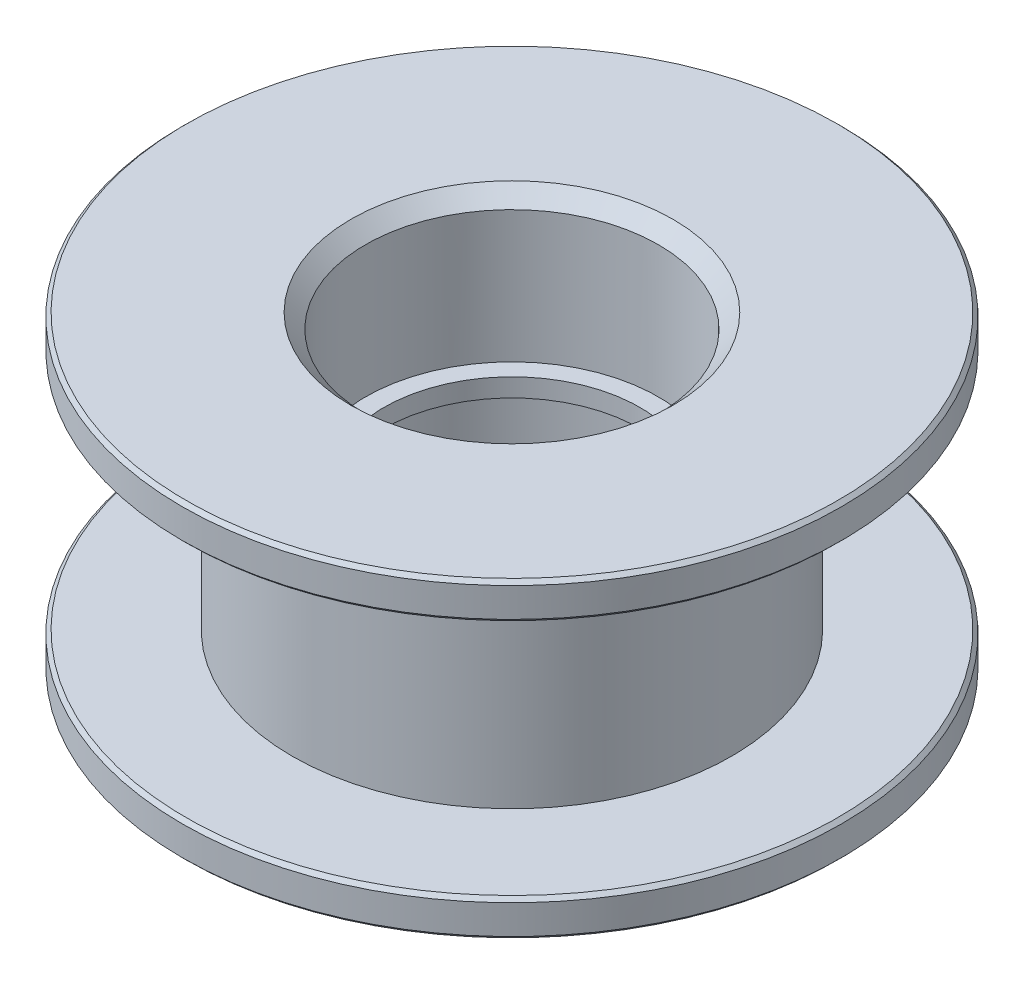
ISO-10303-21;
HEADER;
FILE_DESCRIPTION(('STEP AP214'),'2;1');
FILE_NAME('part.step','',(''),(''),'','','');
FILE_SCHEMA(('AUTOMOTIVE_DESIGN { 1 0 10303 214 1 1 1 1 }'));
ENDSEC;
DATA;
#1=APPLICATION_CONTEXT('core data for automotive mechanical design processes');
#2=APPLICATION_PROTOCOL_DEFINITION('international standard','automotive_design',2000,#1);
#3=PRODUCT_CONTEXT('',#1,'mechanical');
#4=PRODUCT('Part','Part','',(#3));
#5=PRODUCT_RELATED_PRODUCT_CATEGORY('part','',(#4));
#6=PRODUCT_DEFINITION_FORMATION('','',#4);
#7=PRODUCT_DEFINITION_CONTEXT('part definition',#1,'design');
#8=PRODUCT_DEFINITION('design','',#6,#7);
#9=PRODUCT_DEFINITION_SHAPE('','',#8);
#10=(LENGTH_UNIT() NAMED_UNIT(*) SI_UNIT(.MILLI.,.METRE.));
#11=(NAMED_UNIT(*) PLANE_ANGLE_UNIT() SI_UNIT($,.RADIAN.));
#12=(NAMED_UNIT(*) SI_UNIT($,.STERADIAN.) SOLID_ANGLE_UNIT());
#13=UNCERTAINTY_MEASURE_WITH_UNIT(LENGTH_MEASURE(1.E-05),#10,'distance_accuracy_value','');
#14=(GEOMETRIC_REPRESENTATION_CONTEXT(3) GLOBAL_UNCERTAINTY_ASSIGNED_CONTEXT((#13)) GLOBAL_UNIT_ASSIGNED_CONTEXT((#10,
#11,#12)) REPRESENTATION_CONTEXT('',''));
#15=CARTESIAN_POINT('',(0.,0.,0.));
#16=DIRECTION('',(0.,0.,1.));
#17=DIRECTION('',(1.,0.,0.));
#18=AXIS2_PLACEMENT_3D('',#15,#16,#17);
#19=CARTESIAN_POINT('',(6.,3.25,0.));
#20=DIRECTION('',(0.,1.,0.));
#21=DIRECTION('',(0.,0.,1.));
#22=AXIS2_PLACEMENT_3D('',#19,#20,#21);
#23=PLANE('',#22);
#24=CARTESIAN_POINT('',(0.,3.25,0.));
#25=DIRECTION('',(0.,1.,0.));
#26=DIRECTION('',(0.,0.,1.));
#27=AXIS2_PLACEMENT_3D('',#24,#25,#26);
#28=CIRCLE('',#27,8.9);
#29=CARTESIAN_POINT('',(0.,3.25,8.9));
#30=VERTEX_POINT('',#29);
#31=EDGE_CURVE('E42',#30,#30,#28,.F.);
#32=ORIENTED_EDGE('',*,*,#31,.T.);
#33=EDGE_LOOP('',(#32));
#34=FACE_BOUND('',#33,.T.);
#35=CARTESIAN_POINT('',(0.,3.25,0.));
#36=DIRECTION('',(0.,1.,0.));
#37=DIRECTION('',(0.,0.,1.));
#38=AXIS2_PLACEMENT_3D('',#35,#36,#37);
#39=CIRCLE('',#38,6.);
#40=CARTESIAN_POINT('',(0.,3.25,6.));
#41=VERTEX_POINT('',#40);
#42=EDGE_CURVE('E110',#41,#41,#39,.T.);
#43=ORIENTED_EDGE('',*,*,#42,.T.);
#44=EDGE_LOOP('',(#43));
#45=FACE_BOUND('',#44,.T.);
#46=ADVANCED_FACE('F34',(#34,#45),#23,.F.);
#47=CARTESIAN_POINT('',(0.,4.25,0.));
#48=DIRECTION('',(0.,1.,0.));
#49=DIRECTION('',(0.,0.,1.));
#50=AXIS2_PLACEMENT_3D('',#47,#48,#49);
#51=CYLINDRICAL_SURFACE('',#50,9.);
#52=CARTESIAN_POINT('',(0.,3.35,0.));
#53=DIRECTION('',(0.,1.,0.));
#54=DIRECTION('',(0.,0.,1.));
#55=AXIS2_PLACEMENT_3D('',#52,#53,#54);
#56=CIRCLE('',#55,9.);
#57=CARTESIAN_POINT('',(0.,3.35,9.));
#58=VERTEX_POINT('',#57);
#59=EDGE_CURVE('E49',#58,#58,#56,.T.);
#60=ORIENTED_EDGE('',*,*,#59,.T.);
#61=EDGE_LOOP('',(#60));
#62=FACE_BOUND('',#61,.T.);
#63=CARTESIAN_POINT('',(0.,4.15,0.));
#64=DIRECTION('',(0.,-1.,0.));
#65=DIRECTION('',(0.,0.,-1.));
#66=AXIS2_PLACEMENT_3D('',#63,#64,#65);
#67=CIRCLE('',#66,9.);
#68=CARTESIAN_POINT('',(0.,4.15,-9.));
#69=VERTEX_POINT('',#68);
#70=EDGE_CURVE('E56',#69,#69,#67,.T.);
#71=ORIENTED_EDGE('',*,*,#70,.T.);
#72=EDGE_LOOP('',(#71));
#73=FACE_BOUND('',#72,.T.);
#74=ADVANCED_FACE('F135',(#62,#73),#51,.T.);
#75=CARTESIAN_POINT('',(9.,4.25,0.));
#76=DIRECTION('',(0.,-1.,0.));
#77=DIRECTION('',(0.,0.,-1.));
#78=AXIS2_PLACEMENT_3D('',#75,#76,#77);
#79=PLANE('',#78);
#80=CARTESIAN_POINT('',(0.,4.25,0.));
#81=DIRECTION('',(0.,-1.,0.));
#82=DIRECTION('',(0.,0.,-1.));
#83=AXIS2_PLACEMENT_3D('',#80,#81,#82);
#84=CIRCLE('',#83,8.9);
#85=CARTESIAN_POINT('',(0.,4.25,-8.9));
#86=VERTEX_POINT('',#85);
#87=EDGE_CURVE('E10',#86,#86,#84,.F.);
#88=ORIENTED_EDGE('',*,*,#87,.T.);
#89=EDGE_LOOP('',(#88));
#90=FACE_BOUND('',#89,.T.);
#91=CARTESIAN_POINT('',(0.,4.25,0.));
#92=DIRECTION('',(0.,-1.,0.));
#93=DIRECTION('',(0.,0.,-1.));
#94=AXIS2_PLACEMENT_3D('',#91,#92,#93);
#95=CIRCLE('',#94,4.4);
#96=CARTESIAN_POINT('',(0.,4.25,-4.4));
#97=VERTEX_POINT('',#96);
#98=EDGE_CURVE('E76',#97,#97,#95,.T.);
#99=ORIENTED_EDGE('',*,*,#98,.T.);
#100=EDGE_LOOP('',(#99));
#101=FACE_BOUND('',#100,.T.);
#102=ADVANCED_FACE('F140',(#90,#101),#79,.F.);
#103=CARTESIAN_POINT('',(0.,4.25,0.));
#104=DIRECTION('',(0.,1.,0.));
#105=DIRECTION('',(0.,0.,1.));
#106=AXIS2_PLACEMENT_3D('',#103,#104,#105);
#107=CYLINDRICAL_SURFACE('',#106,4.);
#108=CARTESIAN_POINT('',(0.,3.85,0.));
#109=DIRECTION('',(0.,-1.,0.));
#110=DIRECTION('',(0.,0.,-1.));
#111=AXIS2_PLACEMENT_3D('',#108,#109,#110);
#112=CIRCLE('',#111,4.);
#113=CARTESIAN_POINT('',(0.,3.85,-4.));
#114=VERTEX_POINT('',#113);
#115=EDGE_CURVE('E80',#114,#114,#112,.F.);
#116=ORIENTED_EDGE('',*,*,#115,.T.);
#117=EDGE_LOOP('',(#116));
#118=FACE_BOUND('',#117,.T.);
#119=CARTESIAN_POINT('',(0.,0.25,0.));
#120=DIRECTION('',(0.,1.,0.));
#121=DIRECTION('',(0.,0.,1.));
#122=AXIS2_PLACEMENT_3D('',#119,#120,#121);
#123=CIRCLE('',#122,4.);
#124=CARTESIAN_POINT('',(0.,0.25,4.));
#125=VERTEX_POINT('',#124);
#126=EDGE_CURVE('E90',#125,#125,#123,.T.);
#127=ORIENTED_EDGE('',*,*,#126,.F.);
#128=EDGE_LOOP('',(#127));
#129=FACE_BOUND('',#128,.T.);
#130=ADVANCED_FACE('F255',(#118,#129),#107,.F.);
#131=CARTESIAN_POINT('',(4.,0.25,0.));
#132=DIRECTION('',(0.,-1.,0.));
#133=DIRECTION('',(0.,0.,-1.));
#134=AXIS2_PLACEMENT_3D('',#131,#132,#133);
#135=PLANE('',#134);
#136=CARTESIAN_POINT('',(0.,0.25,0.));
#137=DIRECTION('',(0.,1.,0.));
#138=DIRECTION('',(0.,0.,1.));
#139=AXIS2_PLACEMENT_3D('',#136,#137,#138);
#140=CIRCLE('',#139,3.5);
#141=CARTESIAN_POINT('',(0.,0.25,3.5));
#142=VERTEX_POINT('',#141);
#143=EDGE_CURVE('E94',#142,#142,#140,.T.);
#144=ORIENTED_EDGE('',*,*,#143,.F.);
#145=EDGE_LOOP('',(#144));
#146=FACE_BOUND('',#145,.T.);
#147=ORIENTED_EDGE('',*,*,#126,.T.);
#148=EDGE_LOOP('',(#147));
#149=FACE_BOUND('',#148,.T.);
#150=ADVANCED_FACE('F246',(#146,#149),#135,.F.);
#151=CARTESIAN_POINT('',(0.,4.25,0.));
#152=DIRECTION('',(0.,1.,0.));
#153=DIRECTION('',(0.,0.,1.));
#154=AXIS2_PLACEMENT_3D('',#151,#152,#153);
#155=CYLINDRICAL_SURFACE('',#154,3.5);
#156=CARTESIAN_POINT('',(0.,-0.25,0.));
#157=DIRECTION('',(0.,1.,0.));
#158=DIRECTION('',(0.,0.,1.));
#159=AXIS2_PLACEMENT_3D('',#156,#157,#158);
#160=CIRCLE('',#159,3.5);
#161=CARTESIAN_POINT('',(0.,-0.25,3.5));
#162=VERTEX_POINT('',#161);
#163=EDGE_CURVE('E98',#162,#162,#160,.T.);
#164=ORIENTED_EDGE('',*,*,#163,.F.);
#165=EDGE_LOOP('',(#164));
#166=FACE_BOUND('',#165,.T.);
#167=ORIENTED_EDGE('',*,*,#143,.T.);
#168=EDGE_LOOP('',(#167));
#169=FACE_BOUND('',#168,.T.);
#170=ADVANCED_FACE('F237',(#166,#169),#155,.F.);
#171=CARTESIAN_POINT('',(3.5,-0.25,0.));
#172=DIRECTION('',(0.,1.,0.));
#173=DIRECTION('',(0.,0.,1.));
#174=AXIS2_PLACEMENT_3D('',#171,#172,#173);
#175=PLANE('',#174);
#176=CARTESIAN_POINT('',(0.,-0.25,0.));
#177=DIRECTION('',(0.,1.,0.));
#178=DIRECTION('',(0.,0.,1.));
#179=AXIS2_PLACEMENT_3D('',#176,#177,#178);
#180=CIRCLE('',#179,4.);
#181=CARTESIAN_POINT('',(0.,-0.25,4.));
#182=VERTEX_POINT('',#181);
#183=EDGE_CURVE('E102',#182,#182,#180,.T.);
#184=ORIENTED_EDGE('',*,*,#183,.F.);
#185=EDGE_LOOP('',(#184));
#186=FACE_BOUND('',#185,.T.);
#187=ORIENTED_EDGE('',*,*,#163,.T.);
#188=EDGE_LOOP('',(#187));
#189=FACE_BOUND('',#188,.T.);
#190=ADVANCED_FACE('F229',(#186,#189),#175,.F.);
#191=CARTESIAN_POINT('',(0.,4.25,0.));
#192=DIRECTION('',(0.,1.,0.));
#193=DIRECTION('',(0.,0.,1.));
#194=AXIS2_PLACEMENT_3D('',#191,#192,#193);
#195=CYLINDRICAL_SURFACE('',#194,4.);
#196=CARTESIAN_POINT('',(0.,-3.85,0.));
#197=DIRECTION('',(0.,1.,0.));
#198=DIRECTION('',(0.,0.,1.));
#199=AXIS2_PLACEMENT_3D('',#196,#197,#198);
#200=CIRCLE('',#199,4.);
#201=CARTESIAN_POINT('',(0.,-3.85,4.));
#202=VERTEX_POINT('',#201);
#203=EDGE_CURVE('E83',#202,#202,#200,.F.);
#204=ORIENTED_EDGE('',*,*,#203,.T.);
#205=EDGE_LOOP('',(#204));
#206=FACE_BOUND('',#205,.T.);
#207=ORIENTED_EDGE('',*,*,#183,.T.);
#208=EDGE_LOOP('',(#207));
#209=FACE_BOUND('',#208,.T.);
#210=ADVANCED_FACE('F220',(#206,#209),#195,.F.);
#211=CARTESIAN_POINT('',(4.,-4.25,0.));
#212=DIRECTION('',(0.,1.,0.));
#213=DIRECTION('',(0.,0.,1.));
#214=AXIS2_PLACEMENT_3D('',#211,#212,#213);
#215=PLANE('',#214);
#216=CARTESIAN_POINT('',(0.,-4.25,0.));
#217=DIRECTION('',(0.,1.,0.));
#218=DIRECTION('',(0.,0.,1.));
#219=AXIS2_PLACEMENT_3D('',#216,#217,#218);
#220=CIRCLE('',#219,8.9);
#221=CARTESIAN_POINT('',(0.,-4.25,8.9));
#222=VERTEX_POINT('',#221);
#223=EDGE_CURVE('E65',#222,#222,#220,.F.);
#224=ORIENTED_EDGE('',*,*,#223,.T.);
#225=EDGE_LOOP('',(#224));
#226=FACE_BOUND('',#225,.T.);
#227=CARTESIAN_POINT('',(0.,-4.25,0.));
#228=DIRECTION('',(0.,1.,0.));
#229=DIRECTION('',(0.,0.,1.));
#230=AXIS2_PLACEMENT_3D('',#227,#228,#229);
#231=CIRCLE('',#230,4.4);
#232=CARTESIAN_POINT('',(0.,-4.25,4.4));
#233=VERTEX_POINT('',#232);
#234=EDGE_CURVE('E86',#233,#233,#231,.T.);
#235=ORIENTED_EDGE('',*,*,#234,.T.);
#236=EDGE_LOOP('',(#235));
#237=FACE_BOUND('',#236,.T.);
#238=ADVANCED_FACE('F131',(#226,#237),#215,.F.);
#239=CARTESIAN_POINT('',(0.,4.25,0.));
#240=DIRECTION('',(0.,1.,0.));
#241=DIRECTION('',(0.,0.,1.));
#242=AXIS2_PLACEMENT_3D('',#239,#240,#241);
#243=CYLINDRICAL_SURFACE('',#242,9.);
#244=CARTESIAN_POINT('',(0.,-4.15,0.));
#245=DIRECTION('',(0.,1.,0.));
#246=DIRECTION('',(0.,0.,1.));
#247=AXIS2_PLACEMENT_3D('',#244,#245,#246);
#248=CIRCLE('',#247,9.);
#249=CARTESIAN_POINT('',(0.,-4.15,9.));
#250=VERTEX_POINT('',#249);
#251=EDGE_CURVE('E69',#250,#250,#248,.T.);
#252=ORIENTED_EDGE('',*,*,#251,.T.);
#253=EDGE_LOOP('',(#252));
#254=FACE_BOUND('',#253,.T.);
#255=CARTESIAN_POINT('',(0.,-3.35,0.));
#256=DIRECTION('',(0.,-1.,0.));
#257=DIRECTION('',(0.,0.,-1.));
#258=AXIS2_PLACEMENT_3D('',#255,#256,#257);
#259=CIRCLE('',#258,9.);
#260=CARTESIAN_POINT('',(0.,-3.35,-9.));
#261=VERTEX_POINT('',#260);
#262=EDGE_CURVE('E73',#261,#261,#259,.T.);
#263=ORIENTED_EDGE('',*,*,#262,.T.);
#264=EDGE_LOOP('',(#263));
#265=FACE_BOUND('',#264,.T.);
#266=ADVANCED_FACE('F125',(#254,#265),#243,.T.);
#267=CARTESIAN_POINT('',(9.,-3.25,0.));
#268=DIRECTION('',(0.,-1.,0.));
#269=DIRECTION('',(0.,0.,-1.));
#270=AXIS2_PLACEMENT_3D('',#267,#268,#269);
#271=PLANE('',#270);
#272=CARTESIAN_POINT('',(0.,-3.25,0.));
#273=DIRECTION('',(0.,-1.,0.));
#274=DIRECTION('',(0.,0.,-1.));
#275=AXIS2_PLACEMENT_3D('',#272,#273,#274);
#276=CIRCLE('',#275,8.9);
#277=CARTESIAN_POINT('',(0.,-3.25,-8.9));
#278=VERTEX_POINT('',#277);
#279=EDGE_CURVE('E62',#278,#278,#276,.F.);
#280=ORIENTED_EDGE('',*,*,#279,.T.);
#281=EDGE_LOOP('',(#280));
#282=FACE_BOUND('',#281,.T.);
#283=CARTESIAN_POINT('',(0.,-3.25,0.));
#284=DIRECTION('',(0.,1.,0.));
#285=DIRECTION('',(0.,0.,1.));
#286=AXIS2_PLACEMENT_3D('',#283,#284,#285);
#287=CIRCLE('',#286,6.);
#288=CARTESIAN_POINT('',(0.,-3.25,6.));
#289=VERTEX_POINT('',#288);
#290=EDGE_CURVE('E106',#289,#289,#287,.T.);
#291=ORIENTED_EDGE('',*,*,#290,.F.);
#292=EDGE_LOOP('',(#291));
#293=FACE_BOUND('',#292,.T.);
#294=ADVANCED_FACE('F120',(#282,#293),#271,.F.);
#295=CARTESIAN_POINT('',(0.,4.25,0.));
#296=DIRECTION('',(0.,1.,0.));
#297=DIRECTION('',(0.,0.,1.));
#298=AXIS2_PLACEMENT_3D('',#295,#296,#297);
#299=CYLINDRICAL_SURFACE('',#298,6.);
#300=ORIENTED_EDGE('',*,*,#42,.F.);
#301=EDGE_LOOP('',(#300));
#302=FACE_BOUND('',#301,.T.);
#303=ORIENTED_EDGE('',*,*,#290,.T.);
#304=EDGE_LOOP('',(#303));
#305=FACE_BOUND('',#304,.T.);
#306=ADVANCED_FACE('F116',(#302,#305),#299,.T.);
#307=CARTESIAN_POINT('',(0.,-4.25,0.));
#308=DIRECTION('',(0.,-1.,0.));
#309=DIRECTION('',(0.,0.,-1.));
#310=AXIS2_PLACEMENT_3D('',#307,#308,#309);
#311=CONICAL_SURFACE('',#310,4.4,0.785398163397444);
#312=ORIENTED_EDGE('',*,*,#203,.F.);
#313=EDGE_LOOP('',(#312));
#314=FACE_BOUND('',#313,.T.);
#315=ORIENTED_EDGE('',*,*,#234,.F.);
#316=EDGE_LOOP('',(#315));
#317=FACE_BOUND('',#316,.T.);
#318=ADVANCED_FACE('F119',(#314,#317),#311,.F.);
#319=CARTESIAN_POINT('',(0.,3.85,0.));
#320=DIRECTION('',(0.,1.,0.));
#321=DIRECTION('',(0.,0.,1.));
#322=AXIS2_PLACEMENT_3D('',#319,#320,#321);
#323=CONICAL_SURFACE('',#322,4.,0.785398163397453);
#324=ORIENTED_EDGE('',*,*,#98,.F.);
#325=EDGE_LOOP('',(#324));
#326=FACE_BOUND('',#325,.T.);
#327=ORIENTED_EDGE('',*,*,#115,.F.);
#328=EDGE_LOOP('',(#327));
#329=FACE_BOUND('',#328,.T.);
#330=ADVANCED_FACE('F147',(#326,#329),#323,.F.);
#331=CARTESIAN_POINT('',(0.,-4.15,0.));
#332=DIRECTION('',(0.,1.,0.));
#333=DIRECTION('',(0.,0.,1.));
#334=AXIS2_PLACEMENT_3D('',#331,#332,#333);
#335=CONICAL_SURFACE('',#334,9.,0.785398163397448);
#336=ORIENTED_EDGE('',*,*,#223,.F.);
#337=EDGE_LOOP('',(#336));
#338=FACE_BOUND('',#337,.T.);
#339=ORIENTED_EDGE('',*,*,#251,.F.);
#340=EDGE_LOOP('',(#339));
#341=FACE_BOUND('',#340,.T.);
#342=ADVANCED_FACE('F151',(#338,#341),#335,.T.);
#343=CARTESIAN_POINT('',(0.,-3.25,0.));
#344=DIRECTION('',(0.,-1.,0.));
#345=DIRECTION('',(0.,0.,-1.));
#346=AXIS2_PLACEMENT_3D('',#343,#344,#345);
#347=CONICAL_SURFACE('',#346,8.9,0.785398163397448);
#348=ORIENTED_EDGE('',*,*,#262,.F.);
#349=EDGE_LOOP('',(#348));
#350=FACE_BOUND('',#349,.T.);
#351=ORIENTED_EDGE('',*,*,#279,.F.);
#352=EDGE_LOOP('',(#351));
#353=FACE_BOUND('',#352,.T.);
#354=ADVANCED_FACE('F155',(#350,#353),#347,.T.);
#355=CARTESIAN_POINT('',(0.,3.35,0.));
#356=DIRECTION('',(0.,1.,0.));
#357=DIRECTION('',(0.,0.,1.));
#358=AXIS2_PLACEMENT_3D('',#355,#356,#357);
#359=CONICAL_SURFACE('',#358,9.,0.785398163397457);
#360=ORIENTED_EDGE('',*,*,#31,.F.);
#361=EDGE_LOOP('',(#360));
#362=FACE_BOUND('',#361,.T.);
#363=ORIENTED_EDGE('',*,*,#59,.F.);
#364=EDGE_LOOP('',(#363));
#365=FACE_BOUND('',#364,.T.);
#366=ADVANCED_FACE('F158',(#362,#365),#359,.T.);
#367=CARTESIAN_POINT('',(0.,4.25,0.));
#368=DIRECTION('',(0.,-1.,0.));
#369=DIRECTION('',(0.,0.,-1.));
#370=AXIS2_PLACEMENT_3D('',#367,#368,#369);
#371=CONICAL_SURFACE('',#370,8.9,0.785398163397448);
#372=ORIENTED_EDGE('',*,*,#70,.F.);
#373=EDGE_LOOP('',(#372));
#374=FACE_BOUND('',#373,.T.);
#375=ORIENTED_EDGE('',*,*,#87,.F.);
#376=EDGE_LOOP('',(#375));
#377=FACE_BOUND('',#376,.T.);
#378=ADVANCED_FACE('F36',(#374,#377),#371,.T.);
#379=CLOSED_SHELL('',(#46,#74,#102,#130,#150,#170,#190,#210,#238,#266,#294,#306,#318,#330,#342,
#354,#366,#378));
#380=MANIFOLD_SOLID_BREP('B2',#379);
#381=ADVANCED_BREP_SHAPE_REPRESENTATION('',(#18,#380),#14);
#382=SHAPE_DEFINITION_REPRESENTATION(#9,#381);
ENDSEC;
END-ISO-10303-21;
